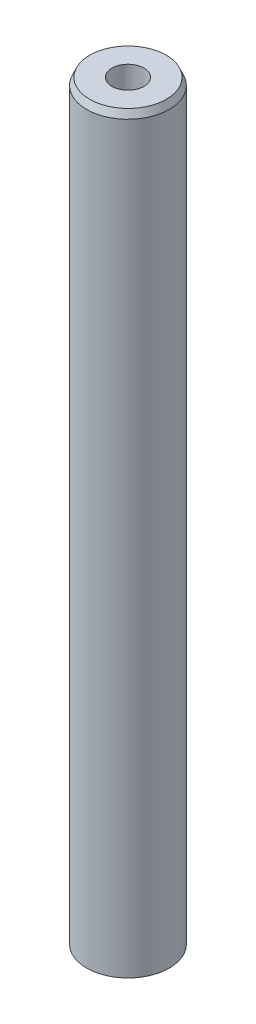
ISO-10303-21;
HEADER;
FILE_DESCRIPTION(('STEP AP214'),'2;1');
FILE_NAME('part.step','',(''),(''),'','','');
FILE_SCHEMA(('AUTOMOTIVE_DESIGN { 1 0 10303 214 1 1 1 1 }'));
ENDSEC;
DATA;
#1=APPLICATION_CONTEXT('core data for automotive mechanical design processes');
#2=APPLICATION_PROTOCOL_DEFINITION('international standard','automotive_design',2000,#1);
#3=PRODUCT_CONTEXT('',#1,'mechanical');
#4=PRODUCT('Part','Part','',(#3));
#5=PRODUCT_RELATED_PRODUCT_CATEGORY('part','',(#4));
#6=PRODUCT_DEFINITION_FORMATION('','',#4);
#7=PRODUCT_DEFINITION_CONTEXT('part definition',#1,'design');
#8=PRODUCT_DEFINITION('design','',#6,#7);
#9=PRODUCT_DEFINITION_SHAPE('','',#8);
#10=(LENGTH_UNIT() NAMED_UNIT(*) SI_UNIT(.MILLI.,.METRE.));
#11=(NAMED_UNIT(*) PLANE_ANGLE_UNIT() SI_UNIT($,.RADIAN.));
#12=(NAMED_UNIT(*) SI_UNIT($,.STERADIAN.) SOLID_ANGLE_UNIT());
#13=UNCERTAINTY_MEASURE_WITH_UNIT(LENGTH_MEASURE(1.E-05),#10,'distance_accuracy_value','');
#14=(GEOMETRIC_REPRESENTATION_CONTEXT(3) GLOBAL_UNCERTAINTY_ASSIGNED_CONTEXT((#13)) GLOBAL_UNIT_ASSIGNED_CONTEXT((#10,
#11,#12)) REPRESENTATION_CONTEXT('',''));
#15=CARTESIAN_POINT('',(0.,0.,0.));
#16=DIRECTION('',(0.,0.,1.));
#17=DIRECTION('',(1.,0.,0.));
#18=AXIS2_PLACEMENT_3D('',#15,#16,#17);
#19=CARTESIAN_POINT('',(0.,136.810048384391,0.));
#20=DIRECTION('',(0.,-1.,0.));
#21=DIRECTION('',(0.,0.,-1.));
#22=AXIS2_PLACEMENT_3D('',#19,#20,#21);
#23=CYLINDRICAL_SURFACE('',#22,7.5);
#24=CARTESIAN_POINT('',(0.,135.500666517161,0.));
#25=DIRECTION('',(0.,1.,0.));
#26=DIRECTION('',(0.,0.,1.));
#27=AXIS2_PLACEMENT_3D('',#24,#25,#26);
#28=CIRCLE('',#27,7.5);
#29=CARTESIAN_POINT('',(0.,135.500666517161,7.5));
#30=VERTEX_POINT('',#29);
#31=EDGE_CURVE('E50',#30,#30,#28,.F.);
#32=ORIENTED_EDGE('',*,*,#31,.T.);
#33=EDGE_LOOP('',(#32));
#34=FACE_BOUND('',#33,.T.);
#35=CARTESIAN_POINT('',(0.,0.558501711979187,0.));
#36=DIRECTION('',(0.,1.,0.));
#37=DIRECTION('',(0.,0.,1.));
#38=AXIS2_PLACEMENT_3D('',#35,#36,#37);
#39=CIRCLE('',#38,7.5);
#40=CARTESIAN_POINT('',(0.,0.558501711979187,7.5));
#41=VERTEX_POINT('',#40);
#42=EDGE_CURVE('E51',#41,#41,#39,.T.);
#43=ORIENTED_EDGE('',*,*,#42,.T.);
#44=EDGE_LOOP('',(#43));
#45=FACE_BOUND('',#44,.T.);
#46=ADVANCED_FACE('F39',(#34,#45),#23,.T.);
#47=CARTESIAN_POINT('',(0.,136.810048384391,0.));
#48=DIRECTION('',(0.,1.,0.));
#49=DIRECTION('',(0.,0.,1.));
#50=AXIS2_PLACEMENT_3D('',#47,#48,#49);
#51=PLANE('',#50);
#52=CARTESIAN_POINT('',(0.,136.810048384391,0.));
#53=DIRECTION('',(0.,1.,0.));
#54=DIRECTION('',(0.,0.,1.));
#55=AXIS2_PLACEMENT_3D('',#52,#53,#54);
#56=CIRCLE('',#55,6.94149828802088);
#57=CARTESIAN_POINT('',(0.,136.810048384391,6.94149828802088));
#58=VERTEX_POINT('',#57);
#59=EDGE_CURVE('E54',#58,#58,#56,.T.);
#60=ORIENTED_EDGE('',*,*,#59,.T.);
#61=EDGE_LOOP('',(#60));
#62=FACE_BOUND('',#61,.T.);
#63=CARTESIAN_POINT('',(0.,136.810048384391,0.));
#64=DIRECTION('',(0.,1.,0.));
#65=DIRECTION('',(0.,0.,1.));
#66=AXIS2_PLACEMENT_3D('',#63,#64,#65);
#67=CIRCLE('',#66,2.89540393899249);
#68=CARTESIAN_POINT('',(0.,136.810048384391,2.89540393899249));
#69=VERTEX_POINT('',#68);
#70=EDGE_CURVE('E58',#69,#69,#67,.T.);
#71=ORIENTED_EDGE('',*,*,#70,.F.);
#72=EDGE_LOOP('',(#71));
#73=FACE_BOUND('',#72,.T.);
#74=ADVANCED_FACE('F69',(#62,#73),#51,.T.);
#75=CARTESIAN_POINT('',(0.,0.,0.));
#76=DIRECTION('',(0.,1.,0.));
#77=DIRECTION('',(0.,0.,1.));
#78=AXIS2_PLACEMENT_3D('',#75,#76,#77);
#79=PLANE('',#78);
#80=CARTESIAN_POINT('',(0.,0.,0.));
#81=DIRECTION('',(0.,1.,0.));
#82=DIRECTION('',(0.,0.,1.));
#83=AXIS2_PLACEMENT_3D('',#80,#81,#82);
#84=CIRCLE('',#83,6.19061813276967);
#85=CARTESIAN_POINT('',(0.,0.,6.19061813276967));
#86=VERTEX_POINT('',#85);
#87=EDGE_CURVE('E10',#86,#86,#84,.F.);
#88=ORIENTED_EDGE('',*,*,#87,.T.);
#89=EDGE_LOOP('',(#88));
#90=FACE_BOUND('',#89,.T.);
#91=CARTESIAN_POINT('',(0.,0.,0.));
#92=DIRECTION('',(0.,1.,0.));
#93=DIRECTION('',(0.,0.,1.));
#94=AXIS2_PLACEMENT_3D('',#91,#92,#93);
#95=CIRCLE('',#94,2.89540393899249);
#96=CARTESIAN_POINT('',(0.,0.,2.89540393899249));
#97=VERTEX_POINT('',#96);
#98=EDGE_CURVE('E63',#97,#97,#95,.T.);
#99=ORIENTED_EDGE('',*,*,#98,.T.);
#100=EDGE_LOOP('',(#99));
#101=FACE_BOUND('',#100,.T.);
#102=ADVANCED_FACE('F75',(#90,#101),#79,.F.);
#103=CARTESIAN_POINT('',(0.,136.810048384391,0.));
#104=DIRECTION('',(0.,-1.,0.));
#105=DIRECTION('',(0.,0.,-1.));
#106=AXIS2_PLACEMENT_3D('',#103,#104,#105);
#107=CYLINDRICAL_SURFACE('',#106,2.89540393899249);
#108=ORIENTED_EDGE('',*,*,#70,.T.);
#109=EDGE_LOOP('',(#108));
#110=FACE_BOUND('',#109,.T.);
#111=ORIENTED_EDGE('',*,*,#98,.F.);
#112=EDGE_LOOP('',(#111));
#113=FACE_BOUND('',#112,.T.);
#114=ADVANCED_FACE('F70',(#110,#113),#107,.F.);
#115=CARTESIAN_POINT('',(0.,136.810048384391,0.));
#116=DIRECTION('',(0.,-1.,0.));
#117=DIRECTION('',(0.,0.,-1.));
#118=AXIS2_PLACEMENT_3D('',#115,#116,#117);
#119=CONICAL_SURFACE('',#118,6.94149828802088,0.403173006357973);
#120=ORIENTED_EDGE('',*,*,#31,.F.);
#121=EDGE_LOOP('',(#120));
#122=FACE_BOUND('',#121,.T.);
#123=ORIENTED_EDGE('',*,*,#59,.F.);
#124=EDGE_LOOP('',(#123));
#125=FACE_BOUND('',#124,.T.);
#126=ADVANCED_FACE('F81',(#122,#125),#119,.T.);
#127=CARTESIAN_POINT('',(0.,0.558501711979187,0.));
#128=DIRECTION('',(0.,1.,0.));
#129=DIRECTION('',(0.,0.,1.));
#130=AXIS2_PLACEMENT_3D('',#127,#128,#129);
#131=CONICAL_SURFACE('',#130,7.5,1.16762332043691);
#132=ORIENTED_EDGE('',*,*,#87,.F.);
#133=EDGE_LOOP('',(#132));
#134=FACE_BOUND('',#133,.T.);
#135=ORIENTED_EDGE('',*,*,#42,.F.);
#136=EDGE_LOOP('',(#135));
#137=FACE_BOUND('',#136,.T.);
#138=ADVANCED_FACE('F45',(#134,#137),#131,.T.);
#139=CLOSED_SHELL('',(#46,#74,#102,#114,#126,#138));
#140=MANIFOLD_SOLID_BREP('B2',#139);
#141=ADVANCED_BREP_SHAPE_REPRESENTATION('',(#18,#140),#14);
#142=SHAPE_DEFINITION_REPRESENTATION(#9,#141);
ENDSEC;
END-ISO-10303-21;
